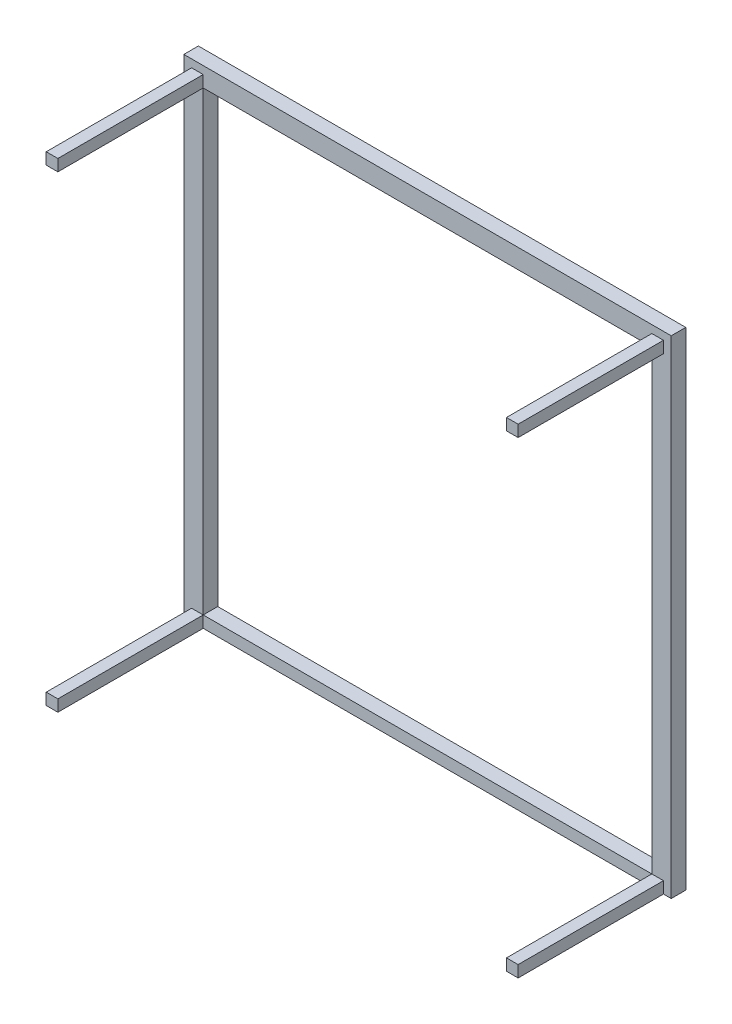
ISO-10303-21;
HEADER;
FILE_DESCRIPTION(('STEP AP214'),'2;1');
FILE_NAME('part.step','',(''),(''),'','','');
FILE_SCHEMA(('AUTOMOTIVE_DESIGN { 1 0 10303 214 1 1 1 1 }'));
ENDSEC;
DATA;
#1=APPLICATION_CONTEXT('core data for automotive mechanical design processes');
#2=APPLICATION_PROTOCOL_DEFINITION('international standard','automotive_design',2000,#1);
#3=PRODUCT_CONTEXT('',#1,'mechanical');
#4=PRODUCT('Part','Part','',(#3));
#5=PRODUCT_RELATED_PRODUCT_CATEGORY('part','',(#4));
#6=PRODUCT_DEFINITION_FORMATION('','',#4);
#7=PRODUCT_DEFINITION_CONTEXT('part definition',#1,'design');
#8=PRODUCT_DEFINITION('design','',#6,#7);
#9=PRODUCT_DEFINITION_SHAPE('','',#8);
#10=(LENGTH_UNIT() NAMED_UNIT(*) SI_UNIT(.MILLI.,.METRE.));
#11=(NAMED_UNIT(*) PLANE_ANGLE_UNIT() SI_UNIT($,.RADIAN.));
#12=(NAMED_UNIT(*) SI_UNIT($,.STERADIAN.) SOLID_ANGLE_UNIT());
#13=UNCERTAINTY_MEASURE_WITH_UNIT(LENGTH_MEASURE(1.E-05),#10,'distance_accuracy_value','');
#14=(GEOMETRIC_REPRESENTATION_CONTEXT(3) GLOBAL_UNCERTAINTY_ASSIGNED_CONTEXT((#13)) GLOBAL_UNIT_ASSIGNED_CONTEXT((#10,
#11,#12)) REPRESENTATION_CONTEXT('',''));
#15=CARTESIAN_POINT('',(0.,0.,0.));
#16=DIRECTION('',(0.,0.,1.));
#17=DIRECTION('',(1.,0.,0.));
#18=AXIS2_PLACEMENT_3D('',#15,#16,#17);
#19=CARTESIAN_POINT('',(0.,0.,15.));
#20=DIRECTION('',(0.,1.,0.));
#21=DIRECTION('',(0.,0.,1.));
#22=AXIS2_PLACEMENT_3D('',#19,#20,#21);
#23=PLANE('',#22);
#24=DIRECTION('',(1.,0.,0.));
#25=VECTOR('',#24,1.);
#26=CARTESIAN_POINT('',(8.,0.,165.));
#27=LINE('',#26,#25);
#28=CARTESIAN_POINT('',(8.,0.,165.));
#29=VERTEX_POINT('',#28);
#30=CARTESIAN_POINT('',(20.0000000000001,0.,165.));
#31=VERTEX_POINT('',#30);
#32=EDGE_CURVE('E183',#29,#31,#27,.T.);
#33=ORIENTED_EDGE('',*,*,#32,.F.);
#34=DIRECTION('',(0.,0.,-1.));
#35=VECTOR('',#34,1.);
#36=CARTESIAN_POINT('',(8.,0.,215.));
#37=LINE('',#36,#35);
#38=CARTESIAN_POINT('',(8.,0.,15.));
#39=VERTEX_POINT('',#38);
#40=EDGE_CURVE('E193',#29,#39,#37,.T.);
#41=ORIENTED_EDGE('',*,*,#40,.T.);
#42=DIRECTION('',(1.,0.,0.));
#43=VECTOR('',#42,1.);
#44=CARTESIAN_POINT('',(0.,0.,15.));
#45=LINE('',#44,#43);
#46=CARTESIAN_POINT('',(0.,0.,15.));
#47=VERTEX_POINT('',#46);
#48=EDGE_CURVE('E291',#47,#39,#45,.T.);
#49=ORIENTED_EDGE('',*,*,#48,.F.);
#50=DIRECTION('',(0.,0.,-1.));
#51=VECTOR('',#50,1.);
#52=CARTESIAN_POINT('',(0.,0.,15.));
#53=LINE('',#52,#51);
#54=CARTESIAN_POINT('',(0.,0.,0.));
#55=VERTEX_POINT('',#54);
#56=EDGE_CURVE('E41',#47,#55,#53,.T.);
#57=ORIENTED_EDGE('',*,*,#56,.T.);
#58=DIRECTION('',(1.,0.,0.));
#59=VECTOR('',#58,1.);
#60=CARTESIAN_POINT('',(0.,0.,0.));
#61=LINE('',#60,#59);
#62=CARTESIAN_POINT('',(503.,0.,0.));
#63=VERTEX_POINT('',#62);
#64=EDGE_CURVE('E301',#55,#63,#61,.T.);
#65=ORIENTED_EDGE('',*,*,#64,.T.);
#66=DIRECTION('',(0.,0.,-1.));
#67=VECTOR('',#66,1.);
#68=CARTESIAN_POINT('',(503.,0.,15.));
#69=LINE('',#68,#67);
#70=CARTESIAN_POINT('',(503.,0.,15.));
#71=VERTEX_POINT('',#70);
#72=EDGE_CURVE('E311',#71,#63,#69,.T.);
#73=ORIENTED_EDGE('',*,*,#72,.F.);
#74=CARTESIAN_POINT('',(495.,0.,15.));
#75=VERTEX_POINT('',#74);
#76=EDGE_CURVE('E289',#75,#71,#45,.T.);
#77=ORIENTED_EDGE('',*,*,#76,.F.);
#78=DIRECTION('',(0.,0.,-1.));
#79=VECTOR('',#78,1.);
#80=CARTESIAN_POINT('',(495.,0.,215.));
#81=LINE('',#80,#79);
#82=CARTESIAN_POINT('',(495.,0.,165.));
#83=VERTEX_POINT('',#82);
#84=EDGE_CURVE('E370',#83,#75,#81,.T.);
#85=ORIENTED_EDGE('',*,*,#84,.F.);
#86=CARTESIAN_POINT('',(483.,0.,165.));
#87=VERTEX_POINT('',#86);
#88=EDGE_CURVE('E197',#87,#83,#27,.T.);
#89=ORIENTED_EDGE('',*,*,#88,.F.);
#90=DIRECTION('',(0.,0.,-1.));
#91=VECTOR('',#90,1.);
#92=CARTESIAN_POINT('',(483.,0.,215.));
#93=LINE('',#92,#91);
#94=CARTESIAN_POINT('',(483.,0.,15.));
#95=VERTEX_POINT('',#94);
#96=EDGE_CURVE('E354',#87,#95,#93,.T.);
#97=ORIENTED_EDGE('',*,*,#96,.T.);
#98=CARTESIAN_POINT('',(20.0000000000001,0.,15.));
#99=VERTEX_POINT('',#98);
#100=EDGE_CURVE('E294',#99,#95,#45,.T.);
#101=ORIENTED_EDGE('',*,*,#100,.F.);
#102=DIRECTION('',(0.,0.,-1.));
#103=VECTOR('',#102,1.);
#104=CARTESIAN_POINT('',(20.0000000000001,0.,215.));
#105=LINE('',#104,#103);
#106=EDGE_CURVE('E196',#31,#99,#105,.T.);
#107=ORIENTED_EDGE('',*,*,#106,.F.);
#108=EDGE_LOOP('',(#33,#41,#49,#57,#65,#73,#77,#85,#89,#97,#101,#107));
#109=FACE_BOUND('',#108,.T.);
#110=ADVANCED_FACE('F33',(#109),#23,.F.);
#111=CARTESIAN_POINT('',(20.,483.,215.));
#112=DIRECTION('',(-1.,0.,0.));
#113=DIRECTION('',(0.,0.,1.));
#114=AXIS2_PLACEMENT_3D('',#111,#112,#113);
#115=PLANE('',#114);
#116=DIRECTION('',(0.,1.,0.));
#117=VECTOR('',#116,1.);
#118=CARTESIAN_POINT('',(20.,483.,165.));
#119=LINE('',#118,#117);
#120=CARTESIAN_POINT('',(20.,483.,165.));
#121=VERTEX_POINT('',#120);
#122=CARTESIAN_POINT('',(20.,495.,165.));
#123=VERTEX_POINT('',#122);
#124=EDGE_CURVE('E357',#121,#123,#119,.T.);
#125=ORIENTED_EDGE('',*,*,#124,.F.);
#126=DIRECTION('',(0.,0.,-1.));
#127=VECTOR('',#126,1.);
#128=CARTESIAN_POINT('',(20.,483.,215.));
#129=LINE('',#128,#127);
#130=CARTESIAN_POINT('',(20.,483.,15.));
#131=VERTEX_POINT('',#130);
#132=EDGE_CURVE('E243',#121,#131,#129,.T.);
#133=ORIENTED_EDGE('',*,*,#132,.T.);
#134=DIRECTION('',(0.,1.,0.));
#135=VECTOR('',#134,1.);
#136=CARTESIAN_POINT('',(20.,483.,15.));
#137=LINE('',#136,#135);
#138=CARTESIAN_POINT('',(20.,495.,15.));
#139=VERTEX_POINT('',#138);
#140=EDGE_CURVE('E231',#131,#139,#137,.T.);
#141=ORIENTED_EDGE('',*,*,#140,.T.);
#142=DIRECTION('',(0.,0.,-1.));
#143=VECTOR('',#142,1.);
#144=CARTESIAN_POINT('',(20.,495.,215.));
#145=LINE('',#144,#143);
#146=EDGE_CURVE('E249',#123,#139,#145,.T.);
#147=ORIENTED_EDGE('',*,*,#146,.F.);
#148=EDGE_LOOP('',(#125,#133,#141,#147));
#149=FACE_BOUND('',#148,.T.);
#150=ADVANCED_FACE('F408',(#149),#115,.F.);
#151=CARTESIAN_POINT('',(20.,495.,215.));
#152=DIRECTION('',(0.,-1.,0.));
#153=DIRECTION('',(0.,0.,-1.));
#154=AXIS2_PLACEMENT_3D('',#151,#152,#153);
#155=PLANE('',#154);
#156=DIRECTION('',(-1.,0.,0.));
#157=VECTOR('',#156,1.);
#158=CARTESIAN_POINT('',(8.,495.,165.));
#159=LINE('',#158,#157);
#160=CARTESIAN_POINT('',(8.,495.,165.));
#161=VERTEX_POINT('',#160);
#162=EDGE_CURVE('E418',#123,#161,#159,.T.);
#163=ORIENTED_EDGE('',*,*,#162,.F.);
#164=ORIENTED_EDGE('',*,*,#146,.T.);
#165=DIRECTION('',(-1.,0.,0.));
#166=VECTOR('',#165,1.);
#167=CARTESIAN_POINT('',(20.,495.,15.));
#168=LINE('',#167,#166);
#169=CARTESIAN_POINT('',(8.,495.,15.));
#170=VERTEX_POINT('',#169);
#171=EDGE_CURVE('E234',#139,#170,#168,.T.);
#172=ORIENTED_EDGE('',*,*,#171,.T.);
#173=DIRECTION('',(0.,0.,-1.));
#174=VECTOR('',#173,1.);
#175=CARTESIAN_POINT('',(8.,495.,215.));
#176=LINE('',#175,#174);
#177=EDGE_CURVE('E247',#161,#170,#176,.T.);
#178=ORIENTED_EDGE('',*,*,#177,.F.);
#179=EDGE_LOOP('',(#163,#164,#172,#178));
#180=FACE_BOUND('',#179,.T.);
#181=ADVANCED_FACE('F417',(#180),#155,.F.);
#182=CARTESIAN_POINT('',(8.,483.,215.));
#183=DIRECTION('',(1.,0.,0.));
#184=DIRECTION('',(0.,0.,-1.));
#185=AXIS2_PLACEMENT_3D('',#182,#183,#184);
#186=PLANE('',#185);
#187=DIRECTION('',(0.,-1.,0.));
#188=VECTOR('',#187,1.);
#189=CARTESIAN_POINT('',(8.,495.,165.));
#190=LINE('',#189,#188);
#191=CARTESIAN_POINT('',(8.,483.,165.));
#192=VERTEX_POINT('',#191);
#193=EDGE_CURVE('E48',#161,#192,#190,.T.);
#194=ORIENTED_EDGE('',*,*,#193,.F.);
#195=ORIENTED_EDGE('',*,*,#177,.T.);
#196=DIRECTION('',(0.,-1.,0.));
#197=VECTOR('',#196,1.);
#198=CARTESIAN_POINT('',(8.,483.,15.));
#199=LINE('',#198,#197);
#200=CARTESIAN_POINT('',(8.,483.,15.));
#201=VERTEX_POINT('',#200);
#202=EDGE_CURVE('E237',#170,#201,#199,.T.);
#203=ORIENTED_EDGE('',*,*,#202,.T.);
#204=DIRECTION('',(0.,0.,-1.));
#205=VECTOR('',#204,1.);
#206=CARTESIAN_POINT('',(8.,483.,215.));
#207=LINE('',#206,#205);
#208=EDGE_CURVE('E245',#192,#201,#207,.T.);
#209=ORIENTED_EDGE('',*,*,#208,.F.);
#210=EDGE_LOOP('',(#194,#195,#203,#209));
#211=FACE_BOUND('',#210,.T.);
#212=ADVANCED_FACE('F414',(#211),#186,.F.);
#213=CARTESIAN_POINT('',(20.,483.,215.));
#214=DIRECTION('',(0.,1.,0.));
#215=DIRECTION('',(0.,0.,1.));
#216=AXIS2_PLACEMENT_3D('',#213,#214,#215);
#217=PLANE('',#216);
#218=DIRECTION('',(1.,0.,0.));
#219=VECTOR('',#218,1.);
#220=CARTESIAN_POINT('',(20.,483.,165.));
#221=LINE('',#220,#219);
#222=EDGE_CURVE('E361',#192,#121,#221,.T.);
#223=ORIENTED_EDGE('',*,*,#222,.F.);
#224=ORIENTED_EDGE('',*,*,#208,.T.);
#225=DIRECTION('',(1.,0.,0.));
#226=VECTOR('',#225,1.);
#227=CARTESIAN_POINT('',(20.,483.,15.));
#228=LINE('',#227,#226);
#229=EDGE_CURVE('E240',#201,#131,#228,.T.);
#230=ORIENTED_EDGE('',*,*,#229,.T.);
#231=ORIENTED_EDGE('',*,*,#132,.F.);
#232=EDGE_LOOP('',(#223,#224,#230,#231));
#233=FACE_BOUND('',#232,.T.);
#234=ADVANCED_FACE('F410',(#233),#217,.F.);
#235=CARTESIAN_POINT('',(483.,483.,215.));
#236=DIRECTION('',(1.,0.,0.));
#237=DIRECTION('',(0.,0.,-1.));
#238=AXIS2_PLACEMENT_3D('',#235,#236,#237);
#239=PLANE('',#238);
#240=DIRECTION('',(0.,-1.,0.));
#241=VECTOR('',#240,1.);
#242=CARTESIAN_POINT('',(483.,483.,165.));
#243=LINE('',#242,#241);
#244=CARTESIAN_POINT('',(483.,495.,165.));
#245=VERTEX_POINT('',#244);
#246=CARTESIAN_POINT('',(483.,483.,165.));
#247=VERTEX_POINT('',#246);
#248=EDGE_CURVE('E394',#245,#247,#243,.T.);
#249=ORIENTED_EDGE('',*,*,#248,.F.);
#250=DIRECTION('',(0.,0.,-1.));
#251=VECTOR('',#250,1.);
#252=CARTESIAN_POINT('',(483.,495.,215.));
#253=LINE('',#252,#251);
#254=CARTESIAN_POINT('',(483.,495.,15.));
#255=VERTEX_POINT('',#254);
#256=EDGE_CURVE('E223',#245,#255,#253,.T.);
#257=ORIENTED_EDGE('',*,*,#256,.T.);
#258=DIRECTION('',(0.,-1.,0.));
#259=VECTOR('',#258,1.);
#260=CARTESIAN_POINT('',(483.,483.,15.));
#261=LINE('',#260,#259);
#262=CARTESIAN_POINT('',(483.,483.,15.));
#263=VERTEX_POINT('',#262);
#264=EDGE_CURVE('E211',#255,#263,#261,.T.);
#265=ORIENTED_EDGE('',*,*,#264,.T.);
#266=DIRECTION('',(0.,0.,-1.));
#267=VECTOR('',#266,1.);
#268=CARTESIAN_POINT('',(483.,483.,215.));
#269=LINE('',#268,#267);
#270=EDGE_CURVE('E229',#247,#263,#269,.T.);
#271=ORIENTED_EDGE('',*,*,#270,.F.);
#272=EDGE_LOOP('',(#249,#257,#265,#271));
#273=FACE_BOUND('',#272,.T.);
#274=ADVANCED_FACE('F482',(#273),#239,.F.);
#275=CARTESIAN_POINT('',(483.,483.,215.));
#276=DIRECTION('',(0.,1.,0.));
#277=DIRECTION('',(0.,0.,1.));
#278=AXIS2_PLACEMENT_3D('',#275,#276,#277);
#279=PLANE('',#278);
#280=DIRECTION('',(1.,0.,0.));
#281=VECTOR('',#280,1.);
#282=CARTESIAN_POINT('',(483.,483.,165.));
#283=LINE('',#282,#281);
#284=CARTESIAN_POINT('',(495.,483.,165.));
#285=VERTEX_POINT('',#284);
#286=EDGE_CURVE('E392',#247,#285,#283,.T.);
#287=ORIENTED_EDGE('',*,*,#286,.F.);
#288=ORIENTED_EDGE('',*,*,#270,.T.);
#289=DIRECTION('',(1.,0.,0.));
#290=VECTOR('',#289,1.);
#291=CARTESIAN_POINT('',(483.,483.,15.));
#292=LINE('',#291,#290);
#293=CARTESIAN_POINT('',(495.,483.,15.));
#294=VERTEX_POINT('',#293);
#295=EDGE_CURVE('E214',#263,#294,#292,.T.);
#296=ORIENTED_EDGE('',*,*,#295,.T.);
#297=DIRECTION('',(0.,0.,-1.));
#298=VECTOR('',#297,1.);
#299=CARTESIAN_POINT('',(495.,483.,215.));
#300=LINE('',#299,#298);
#301=EDGE_CURVE('E227',#285,#294,#300,.T.);
#302=ORIENTED_EDGE('',*,*,#301,.F.);
#303=EDGE_LOOP('',(#287,#288,#296,#302));
#304=FACE_BOUND('',#303,.T.);
#305=ADVANCED_FACE('F485',(#304),#279,.F.);
#306=CARTESIAN_POINT('',(495.,483.,215.));
#307=DIRECTION('',(-1.,0.,0.));
#308=DIRECTION('',(0.,0.,1.));
#309=AXIS2_PLACEMENT_3D('',#306,#307,#308);
#310=PLANE('',#309);
#311=DIRECTION('',(0.,1.,0.));
#312=VECTOR('',#311,1.);
#313=CARTESIAN_POINT('',(495.,495.,165.));
#314=LINE('',#313,#312);
#315=CARTESIAN_POINT('',(495.,495.,165.));
#316=VERTEX_POINT('',#315);
#317=EDGE_CURVE('E56',#285,#316,#314,.T.);
#318=ORIENTED_EDGE('',*,*,#317,.F.);
#319=ORIENTED_EDGE('',*,*,#301,.T.);
#320=DIRECTION('',(0.,1.,0.));
#321=VECTOR('',#320,1.);
#322=CARTESIAN_POINT('',(495.,483.,15.));
#323=LINE('',#322,#321);
#324=CARTESIAN_POINT('',(495.,495.,15.));
#325=VERTEX_POINT('',#324);
#326=EDGE_CURVE('E217',#294,#325,#323,.T.);
#327=ORIENTED_EDGE('',*,*,#326,.T.);
#328=DIRECTION('',(0.,0.,-1.));
#329=VECTOR('',#328,1.);
#330=CARTESIAN_POINT('',(495.,495.,215.));
#331=LINE('',#330,#329);
#332=EDGE_CURVE('E225',#316,#325,#331,.T.);
#333=ORIENTED_EDGE('',*,*,#332,.F.);
#334=EDGE_LOOP('',(#318,#319,#327,#333));
#335=FACE_BOUND('',#334,.T.);
#336=ADVANCED_FACE('F489',(#335),#310,.F.);
#337=CARTESIAN_POINT('',(483.,495.,215.));
#338=DIRECTION('',(0.,-1.,0.));
#339=DIRECTION('',(0.,0.,-1.));
#340=AXIS2_PLACEMENT_3D('',#337,#338,#339);
#341=PLANE('',#340);
#342=EDGE_CURVE('E443',#316,#245,#159,.T.);
#343=ORIENTED_EDGE('',*,*,#342,.F.);
#344=ORIENTED_EDGE('',*,*,#332,.T.);
#345=DIRECTION('',(-1.,0.,0.));
#346=VECTOR('',#345,1.);
#347=CARTESIAN_POINT('',(483.,495.,15.));
#348=LINE('',#347,#346);
#349=EDGE_CURVE('E220',#325,#255,#348,.T.);
#350=ORIENTED_EDGE('',*,*,#349,.T.);
#351=ORIENTED_EDGE('',*,*,#256,.F.);
#352=EDGE_LOOP('',(#343,#344,#350,#351));
#353=FACE_BOUND('',#352,.T.);
#354=ADVANCED_FACE('F493',(#353),#341,.F.);
#355=CARTESIAN_POINT('',(20.0000000000001,12.,215.));
#356=DIRECTION('',(-1.,0.,0.));
#357=DIRECTION('',(0.,0.,1.));
#358=AXIS2_PLACEMENT_3D('',#355,#356,#357);
#359=PLANE('',#358);
#360=DIRECTION('',(0.,1.,0.));
#361=VECTOR('',#360,1.);
#362=CARTESIAN_POINT('',(20.0000000000001,12.,165.));
#363=LINE('',#362,#361);
#364=CARTESIAN_POINT('',(20.0000000000001,12.,165.));
#365=VERTEX_POINT('',#364);
#366=EDGE_CURVE('E391',#31,#365,#363,.T.);
#367=ORIENTED_EDGE('',*,*,#366,.F.);
#368=ORIENTED_EDGE('',*,*,#106,.T.);
#369=DIRECTION('',(0.,1.,0.));
#370=VECTOR('',#369,1.);
#371=CARTESIAN_POINT('',(20.0000000000001,12.,15.));
#372=LINE('',#371,#370);
#373=CARTESIAN_POINT('',(20.0000000000001,12.,15.));
#374=VERTEX_POINT('',#373);
#375=EDGE_CURVE('E349',#99,#374,#372,.T.);
#376=ORIENTED_EDGE('',*,*,#375,.T.);
#377=DIRECTION('',(0.,0.,-1.));
#378=VECTOR('',#377,1.);
#379=CARTESIAN_POINT('',(20.0000000000001,12.,215.));
#380=LINE('',#379,#378);
#381=EDGE_CURVE('E205',#365,#374,#380,.T.);
#382=ORIENTED_EDGE('',*,*,#381,.F.);
#383=EDGE_LOOP('',(#367,#368,#376,#382));
#384=FACE_BOUND('',#383,.T.);
#385=ADVANCED_FACE('F390',(#384),#359,.F.);
#386=CARTESIAN_POINT('',(20.0000000000001,12.,215.));
#387=DIRECTION('',(0.,-1.,0.));
#388=DIRECTION('',(0.,0.,-1.));
#389=AXIS2_PLACEMENT_3D('',#386,#387,#388);
#390=PLANE('',#389);
#391=DIRECTION('',(-1.,0.,0.));
#392=VECTOR('',#391,1.);
#393=CARTESIAN_POINT('',(20.0000000000001,12.,165.));
#394=LINE('',#393,#392);
#395=CARTESIAN_POINT('',(8.,12.,165.));
#396=VERTEX_POINT('',#395);
#397=EDGE_CURVE('E186',#365,#396,#394,.T.);
#398=ORIENTED_EDGE('',*,*,#397,.F.);
#399=ORIENTED_EDGE('',*,*,#381,.T.);
#400=DIRECTION('',(-1.,0.,0.));
#401=VECTOR('',#400,1.);
#402=CARTESIAN_POINT('',(20.0000000000001,12.,15.));
#403=LINE('',#402,#401);
#404=CARTESIAN_POINT('',(8.,12.,15.));
#405=VERTEX_POINT('',#404);
#406=EDGE_CURVE('E374',#374,#405,#403,.T.);
#407=ORIENTED_EDGE('',*,*,#406,.T.);
#408=DIRECTION('',(0.,0.,-1.));
#409=VECTOR('',#408,1.);
#410=CARTESIAN_POINT('',(8.,12.,215.));
#411=LINE('',#410,#409);
#412=EDGE_CURVE('E203',#396,#405,#411,.T.);
#413=ORIENTED_EDGE('',*,*,#412,.F.);
#414=EDGE_LOOP('',(#398,#399,#407,#413));
#415=FACE_BOUND('',#414,.T.);
#416=ADVANCED_FACE('F378',(#415),#390,.F.);
#417=CARTESIAN_POINT('',(8.,12.,215.));
#418=DIRECTION('',(1.,0.,0.));
#419=DIRECTION('',(0.,0.,-1.));
#420=AXIS2_PLACEMENT_3D('',#417,#418,#419);
#421=PLANE('',#420);
#422=EDGE_CURVE('E180',#396,#29,#190,.T.);
#423=ORIENTED_EDGE('',*,*,#422,.F.);
#424=ORIENTED_EDGE('',*,*,#412,.T.);
#425=DIRECTION('',(0.,-1.,0.));
#426=VECTOR('',#425,1.);
#427=CARTESIAN_POINT('',(8.,12.,15.));
#428=LINE('',#427,#426);
#429=EDGE_CURVE('E202',#405,#39,#428,.T.);
#430=ORIENTED_EDGE('',*,*,#429,.T.);
#431=ORIENTED_EDGE('',*,*,#40,.F.);
#432=EDGE_LOOP('',(#423,#424,#430,#431));
#433=FACE_BOUND('',#432,.T.);
#434=ADVANCED_FACE('F200',(#433),#421,.F.);
#435=CARTESIAN_POINT('',(483.,12.,215.));
#436=DIRECTION('',(1.,0.,0.));
#437=DIRECTION('',(0.,0.,-1.));
#438=AXIS2_PLACEMENT_3D('',#435,#436,#437);
#439=PLANE('',#438);
#440=DIRECTION('',(0.,-1.,0.));
#441=VECTOR('',#440,1.);
#442=CARTESIAN_POINT('',(483.,12.,165.));
#443=LINE('',#442,#441);
#444=CARTESIAN_POINT('',(483.,12.,165.));
#445=VERTEX_POINT('',#444);
#446=EDGE_CURVE('E396',#445,#87,#443,.T.);
#447=ORIENTED_EDGE('',*,*,#446,.F.);
#448=DIRECTION('',(0.,0.,-1.));
#449=VECTOR('',#448,1.);
#450=CARTESIAN_POINT('',(483.,12.,215.));
#451=LINE('',#450,#449);
#452=CARTESIAN_POINT('',(483.,12.,15.));
#453=VERTEX_POINT('',#452);
#454=EDGE_CURVE('E356',#445,#453,#451,.T.);
#455=ORIENTED_EDGE('',*,*,#454,.T.);
#456=DIRECTION('',(0.,-1.,0.));
#457=VECTOR('',#456,1.);
#458=CARTESIAN_POINT('',(483.,12.,15.));
#459=LINE('',#458,#457);
#460=EDGE_CURVE('E347',#453,#95,#459,.T.);
#461=ORIENTED_EDGE('',*,*,#460,.T.);
#462=ORIENTED_EDGE('',*,*,#96,.F.);
#463=EDGE_LOOP('',(#447,#455,#461,#462));
#464=FACE_BOUND('',#463,.T.);
#465=ADVANCED_FACE('F353',(#464),#439,.F.);
#466=CARTESIAN_POINT('',(495.,12.,215.));
#467=DIRECTION('',(-1.,0.,0.));
#468=DIRECTION('',(0.,0.,1.));
#469=AXIS2_PLACEMENT_3D('',#466,#467,#468);
#470=PLANE('',#469);
#471=CARTESIAN_POINT('',(495.,12.,165.));
#472=VERTEX_POINT('',#471);
#473=EDGE_CURVE('E438',#83,#472,#314,.T.);
#474=ORIENTED_EDGE('',*,*,#473,.F.);
#475=ORIENTED_EDGE('',*,*,#84,.T.);
#476=DIRECTION('',(0.,1.,0.));
#477=VECTOR('',#476,1.);
#478=CARTESIAN_POINT('',(495.,12.,15.));
#479=LINE('',#478,#477);
#480=CARTESIAN_POINT('',(495.,12.,15.));
#481=VERTEX_POINT('',#480);
#482=EDGE_CURVE('E338',#75,#481,#479,.T.);
#483=ORIENTED_EDGE('',*,*,#482,.T.);
#484=DIRECTION('',(0.,0.,-1.));
#485=VECTOR('',#484,1.);
#486=CARTESIAN_POINT('',(495.,12.,215.));
#487=LINE('',#486,#485);
#488=EDGE_CURVE('E368',#472,#481,#487,.T.);
#489=ORIENTED_EDGE('',*,*,#488,.F.);
#490=EDGE_LOOP('',(#474,#475,#483,#489));
#491=FACE_BOUND('',#490,.T.);
#492=ADVANCED_FACE('F437',(#491),#470,.F.);
#493=CARTESIAN_POINT('',(483.,12.,215.));
#494=DIRECTION('',(0.,-1.,0.));
#495=DIRECTION('',(0.,0.,-1.));
#496=AXIS2_PLACEMENT_3D('',#493,#494,#495);
#497=PLANE('',#496);
#498=DIRECTION('',(-1.,0.,0.));
#499=VECTOR('',#498,1.);
#500=CARTESIAN_POINT('',(483.,12.,165.));
#501=LINE('',#500,#499);
#502=EDGE_CURVE('E11',#472,#445,#501,.T.);
#503=ORIENTED_EDGE('',*,*,#502,.F.);
#504=ORIENTED_EDGE('',*,*,#488,.T.);
#505=DIRECTION('',(-1.,0.,0.));
#506=VECTOR('',#505,1.);
#507=CARTESIAN_POINT('',(483.,12.,15.));
#508=LINE('',#507,#506);
#509=EDGE_CURVE('E359',#481,#453,#508,.T.);
#510=ORIENTED_EDGE('',*,*,#509,.T.);
#511=ORIENTED_EDGE('',*,*,#454,.F.);
#512=EDGE_LOOP('',(#503,#504,#510,#511));
#513=FACE_BOUND('',#512,.T.);
#514=ADVANCED_FACE('F433',(#513),#497,.F.);
#515=CARTESIAN_POINT('',(0.,0.,15.));
#516=DIRECTION('',(0.,0.,-1.));
#517=DIRECTION('',(-1.,0.,0.));
#518=AXIS2_PLACEMENT_3D('',#515,#516,#517);
#519=PLANE('',#518);
#520=ORIENTED_EDGE('',*,*,#460,.F.);
#521=DIRECTION('',(1.,0.,0.));
#522=VECTOR('',#521,1.);
#523=CARTESIAN_POINT('',(20.0000000000001,12.,15.));
#524=LINE('',#523,#522);
#525=EDGE_CURVE('E255',#374,#453,#524,.T.);
#526=ORIENTED_EDGE('',*,*,#525,.F.);
#527=ORIENTED_EDGE('',*,*,#375,.F.);
#528=ORIENTED_EDGE('',*,*,#100,.T.);
#529=EDGE_LOOP('',(#520,#526,#527,#528));
#530=FACE_BOUND('',#529,.T.);
#531=ADVANCED_FACE('F345',(#530),#519,.F.);
#532=ORIENTED_EDGE('',*,*,#482,.F.);
#533=ORIENTED_EDGE('',*,*,#76,.T.);
#534=DIRECTION('',(0.,1.,0.));
#535=VECTOR('',#534,1.);
#536=CARTESIAN_POINT('',(503.,0.,15.));
#537=LINE('',#536,#535);
#538=CARTESIAN_POINT('',(503.,503.,15.));
#539=VERTEX_POINT('',#538);
#540=EDGE_CURVE('E293',#71,#539,#537,.T.);
#541=ORIENTED_EDGE('',*,*,#540,.T.);
#542=DIRECTION('',(-1.,0.,0.));
#543=VECTOR('',#542,1.);
#544=CARTESIAN_POINT('',(0.,503.,15.));
#545=LINE('',#544,#543);
#546=CARTESIAN_POINT('',(0.,503.,15.));
#547=VERTEX_POINT('',#546);
#548=EDGE_CURVE('E296',#539,#547,#545,.T.);
#549=ORIENTED_EDGE('',*,*,#548,.T.);
#550=DIRECTION('',(0.,-1.,0.));
#551=VECTOR('',#550,1.);
#552=CARTESIAN_POINT('',(0.,0.,15.));
#553=LINE('',#552,#551);
#554=EDGE_CURVE('E286',#547,#47,#553,.T.);
#555=ORIENTED_EDGE('',*,*,#554,.T.);
#556=ORIENTED_EDGE('',*,*,#48,.T.);
#557=ORIENTED_EDGE('',*,*,#429,.F.);
#558=ORIENTED_EDGE('',*,*,#406,.F.);
#559=DIRECTION('',(0.,-1.,0.));
#560=VECTOR('',#559,1.);
#561=CARTESIAN_POINT('',(20.,483.,15.));
#562=LINE('',#561,#560);
#563=EDGE_CURVE('E252',#131,#374,#562,.T.);
#564=ORIENTED_EDGE('',*,*,#563,.F.);
#565=ORIENTED_EDGE('',*,*,#229,.F.);
#566=ORIENTED_EDGE('',*,*,#202,.F.);
#567=ORIENTED_EDGE('',*,*,#171,.F.);
#568=ORIENTED_EDGE('',*,*,#140,.F.);
#569=DIRECTION('',(-1.,0.,0.));
#570=VECTOR('',#569,1.);
#571=CARTESIAN_POINT('',(20.,483.,15.));
#572=LINE('',#571,#570);
#573=EDGE_CURVE('E262',#263,#131,#572,.T.);
#574=ORIENTED_EDGE('',*,*,#573,.F.);
#575=ORIENTED_EDGE('',*,*,#264,.F.);
#576=ORIENTED_EDGE('',*,*,#349,.F.);
#577=ORIENTED_EDGE('',*,*,#326,.F.);
#578=ORIENTED_EDGE('',*,*,#295,.F.);
#579=DIRECTION('',(0.,1.,0.));
#580=VECTOR('',#579,1.);
#581=CARTESIAN_POINT('',(483.,483.,15.));
#582=LINE('',#581,#580);
#583=EDGE_CURVE('E259',#453,#263,#582,.T.);
#584=ORIENTED_EDGE('',*,*,#583,.F.);
#585=ORIENTED_EDGE('',*,*,#509,.F.);
#586=EDGE_LOOP('',(#532,#533,#541,#549,#555,#556,#557,#558,#564,#565,#566,#567,#568,#574,#575,
#576,#577,#578,#584,#585));
#587=FACE_BOUND('',#586,.T.);
#588=ADVANCED_FACE('F334',(#587),#519,.F.);
#589=CARTESIAN_POINT('',(0.,0.,0.));
#590=DIRECTION('',(0.,0.,-1.));
#591=DIRECTION('',(-1.,0.,0.));
#592=AXIS2_PLACEMENT_3D('',#589,#590,#591);
#593=PLANE('',#592);
#594=DIRECTION('',(0.,-1.,0.));
#595=VECTOR('',#594,1.);
#596=CARTESIAN_POINT('',(0.,0.,0.));
#597=LINE('',#596,#595);
#598=CARTESIAN_POINT('',(0.,503.,0.));
#599=VERTEX_POINT('',#598);
#600=EDGE_CURVE('E285',#599,#55,#597,.T.);
#601=ORIENTED_EDGE('',*,*,#600,.F.);
#602=DIRECTION('',(-1.,0.,0.));
#603=VECTOR('',#602,1.);
#604=CARTESIAN_POINT('',(0.,503.,0.));
#605=LINE('',#604,#603);
#606=CARTESIAN_POINT('',(503.,503.,0.));
#607=VERTEX_POINT('',#606);
#608=EDGE_CURVE('E290',#607,#599,#605,.T.);
#609=ORIENTED_EDGE('',*,*,#608,.F.);
#610=DIRECTION('',(0.,1.,0.));
#611=VECTOR('',#610,1.);
#612=CARTESIAN_POINT('',(503.,0.,0.));
#613=LINE('',#612,#611);
#614=EDGE_CURVE('E303',#63,#607,#613,.T.);
#615=ORIENTED_EDGE('',*,*,#614,.F.);
#616=ORIENTED_EDGE('',*,*,#64,.F.);
#617=EDGE_LOOP('',(#601,#609,#615,#616));
#618=FACE_BOUND('',#617,.T.);
#619=DIRECTION('',(-1.,0.,0.));
#620=VECTOR('',#619,1.);
#621=CARTESIAN_POINT('',(20.,483.,0.));
#622=LINE('',#621,#620);
#623=CARTESIAN_POINT('',(483.,483.,0.));
#624=VERTEX_POINT('',#623);
#625=CARTESIAN_POINT('',(20.,483.,0.));
#626=VERTEX_POINT('',#625);
#627=EDGE_CURVE('E256',#624,#626,#622,.T.);
#628=ORIENTED_EDGE('',*,*,#627,.T.);
#629=DIRECTION('',(0.,-1.,0.));
#630=VECTOR('',#629,1.);
#631=CARTESIAN_POINT('',(20.,483.,0.));
#632=LINE('',#631,#630);
#633=CARTESIAN_POINT('',(20.0000000000001,12.,0.));
#634=VERTEX_POINT('',#633);
#635=EDGE_CURVE('E251',#626,#634,#632,.T.);
#636=ORIENTED_EDGE('',*,*,#635,.T.);
#637=DIRECTION('',(1.,0.,0.));
#638=VECTOR('',#637,1.);
#639=CARTESIAN_POINT('',(20.0000000000001,12.,0.));
#640=LINE('',#639,#638);
#641=CARTESIAN_POINT('',(483.,12.,0.));
#642=VERTEX_POINT('',#641);
#643=EDGE_CURVE('E268',#634,#642,#640,.T.);
#644=ORIENTED_EDGE('',*,*,#643,.T.);
#645=DIRECTION('',(0.,1.,0.));
#646=VECTOR('',#645,1.);
#647=CARTESIAN_POINT('',(483.,483.,0.));
#648=LINE('',#647,#646);
#649=EDGE_CURVE('E271',#642,#624,#648,.T.);
#650=ORIENTED_EDGE('',*,*,#649,.T.);
#651=EDGE_LOOP('',(#628,#636,#644,#650));
#652=FACE_BOUND('',#651,.T.);
#653=ADVANCED_FACE('F322',(#618,#652),#593,.T.);
#654=CARTESIAN_POINT('',(0.,0.,15.));
#655=DIRECTION('',(1.,0.,0.));
#656=DIRECTION('',(0.,0.,-1.));
#657=AXIS2_PLACEMENT_3D('',#654,#655,#656);
#658=PLANE('',#657);
#659=ORIENTED_EDGE('',*,*,#600,.T.);
#660=ORIENTED_EDGE('',*,*,#56,.F.);
#661=ORIENTED_EDGE('',*,*,#554,.F.);
#662=DIRECTION('',(0.,0.,-1.));
#663=VECTOR('',#662,1.);
#664=CARTESIAN_POINT('',(0.,503.,15.));
#665=LINE('',#664,#663);
#666=EDGE_CURVE('E298',#547,#599,#665,.T.);
#667=ORIENTED_EDGE('',*,*,#666,.T.);
#668=EDGE_LOOP('',(#659,#660,#661,#667));
#669=FACE_BOUND('',#668,.T.);
#670=ADVANCED_FACE('F35',(#669),#658,.F.);
#671=CARTESIAN_POINT('',(503.,0.,15.));
#672=DIRECTION('',(-1.,0.,0.));
#673=DIRECTION('',(0.,0.,1.));
#674=AXIS2_PLACEMENT_3D('',#671,#672,#673);
#675=PLANE('',#674);
#676=ORIENTED_EDGE('',*,*,#614,.T.);
#677=DIRECTION('',(0.,0.,-1.));
#678=VECTOR('',#677,1.);
#679=CARTESIAN_POINT('',(503.,503.,15.));
#680=LINE('',#679,#678);
#681=EDGE_CURVE('E308',#539,#607,#680,.T.);
#682=ORIENTED_EDGE('',*,*,#681,.F.);
#683=ORIENTED_EDGE('',*,*,#540,.F.);
#684=ORIENTED_EDGE('',*,*,#72,.T.);
#685=EDGE_LOOP('',(#676,#682,#683,#684));
#686=FACE_BOUND('',#685,.T.);
#687=ADVANCED_FACE('F327',(#686),#675,.F.);
#688=CARTESIAN_POINT('',(0.,503.,15.));
#689=DIRECTION('',(0.,-1.,0.));
#690=DIRECTION('',(0.,0.,-1.));
#691=AXIS2_PLACEMENT_3D('',#688,#689,#690);
#692=PLANE('',#691);
#693=ORIENTED_EDGE('',*,*,#608,.T.);
#694=ORIENTED_EDGE('',*,*,#666,.F.);
#695=ORIENTED_EDGE('',*,*,#548,.F.);
#696=ORIENTED_EDGE('',*,*,#681,.T.);
#697=EDGE_LOOP('',(#693,#694,#695,#696));
#698=FACE_BOUND('',#697,.T.);
#699=ADVANCED_FACE('F331',(#698),#692,.F.);
#700=CARTESIAN_POINT('',(20.,483.,15.));
#701=DIRECTION('',(1.,0.,0.));
#702=DIRECTION('',(0.,1.,0.));
#703=AXIS2_PLACEMENT_3D('',#700,#701,#702);
#704=PLANE('',#703);
#705=ORIENTED_EDGE('',*,*,#635,.F.);
#706=DIRECTION('',(0.,0.,-1.));
#707=VECTOR('',#706,1.);
#708=CARTESIAN_POINT('',(20.,483.,15.));
#709=LINE('',#708,#707);
#710=EDGE_CURVE('E265',#131,#626,#709,.T.);
#711=ORIENTED_EDGE('',*,*,#710,.F.);
#712=ORIENTED_EDGE('',*,*,#563,.T.);
#713=DIRECTION('',(0.,0.,-1.));
#714=VECTOR('',#713,1.);
#715=CARTESIAN_POINT('',(20.0000000000001,12.,15.));
#716=LINE('',#715,#714);
#717=EDGE_CURVE('E282',#374,#634,#716,.T.);
#718=ORIENTED_EDGE('',*,*,#717,.T.);
#719=EDGE_LOOP('',(#705,#711,#712,#718));
#720=FACE_BOUND('',#719,.T.);
#721=ADVANCED_FACE('F385',(#720),#704,.T.);
#722=CARTESIAN_POINT('',(20.0000000000001,12.,15.));
#723=DIRECTION('',(0.,1.,0.));
#724=DIRECTION('',(0.,0.,1.));
#725=AXIS2_PLACEMENT_3D('',#722,#723,#724);
#726=PLANE('',#725);
#727=ORIENTED_EDGE('',*,*,#643,.F.);
#728=ORIENTED_EDGE('',*,*,#717,.F.);
#729=ORIENTED_EDGE('',*,*,#525,.T.);
#730=DIRECTION('',(0.,0.,-1.));
#731=VECTOR('',#730,1.);
#732=CARTESIAN_POINT('',(483.,12.,15.));
#733=LINE('',#732,#731);
#734=EDGE_CURVE('E280',#453,#642,#733,.T.);
#735=ORIENTED_EDGE('',*,*,#734,.T.);
#736=EDGE_LOOP('',(#727,#728,#729,#735));
#737=FACE_BOUND('',#736,.T.);
#738=ADVANCED_FACE('F387',(#737),#726,.T.);
#739=CARTESIAN_POINT('',(483.,483.,15.));
#740=DIRECTION('',(-1.,0.,0.));
#741=DIRECTION('',(0.,-1.,0.));
#742=AXIS2_PLACEMENT_3D('',#739,#740,#741);
#743=PLANE('',#742);
#744=ORIENTED_EDGE('',*,*,#649,.F.);
#745=ORIENTED_EDGE('',*,*,#734,.F.);
#746=ORIENTED_EDGE('',*,*,#583,.T.);
#747=DIRECTION('',(0.,0.,-1.));
#748=VECTOR('',#747,1.);
#749=CARTESIAN_POINT('',(483.,483.,15.));
#750=LINE('',#749,#748);
#751=EDGE_CURVE('E278',#263,#624,#750,.T.);
#752=ORIENTED_EDGE('',*,*,#751,.T.);
#753=EDGE_LOOP('',(#744,#745,#746,#752));
#754=FACE_BOUND('',#753,.T.);
#755=ADVANCED_FACE('F428',(#754),#743,.T.);
#756=CARTESIAN_POINT('',(20.,483.,15.));
#757=DIRECTION('',(0.,-1.,0.));
#758=DIRECTION('',(0.,0.,-1.));
#759=AXIS2_PLACEMENT_3D('',#756,#757,#758);
#760=PLANE('',#759);
#761=ORIENTED_EDGE('',*,*,#627,.F.);
#762=ORIENTED_EDGE('',*,*,#751,.F.);
#763=ORIENTED_EDGE('',*,*,#573,.T.);
#764=ORIENTED_EDGE('',*,*,#710,.T.);
#765=EDGE_LOOP('',(#761,#762,#763,#764));
#766=FACE_BOUND('',#765,.T.);
#767=ADVANCED_FACE('F424',(#766),#760,.T.);
#768=CARTESIAN_POINT('',(0.,0.,165.));
#769=DIRECTION('',(0.,0.,1.));
#770=DIRECTION('',(1.,0.,0.));
#771=AXIS2_PLACEMENT_3D('',#768,#769,#770);
#772=PLANE('',#771);
#773=ORIENTED_EDGE('',*,*,#446,.T.);
#774=ORIENTED_EDGE('',*,*,#88,.T.);
#775=ORIENTED_EDGE('',*,*,#473,.T.);
#776=ORIENTED_EDGE('',*,*,#502,.T.);
#777=EDGE_LOOP('',(#773,#774,#775,#776));
#778=FACE_BOUND('',#777,.T.);
#779=ADVANCED_FACE('F444',(#778),#772,.T.);
#780=ORIENTED_EDGE('',*,*,#366,.T.);
#781=ORIENTED_EDGE('',*,*,#397,.T.);
#782=ORIENTED_EDGE('',*,*,#422,.T.);
#783=ORIENTED_EDGE('',*,*,#32,.T.);
#784=EDGE_LOOP('',(#780,#781,#782,#783));
#785=FACE_BOUND('',#784,.T.);
#786=ADVANCED_FACE('F182',(#785),#772,.T.);
#787=ORIENTED_EDGE('',*,*,#248,.T.);
#788=ORIENTED_EDGE('',*,*,#286,.T.);
#789=ORIENTED_EDGE('',*,*,#317,.T.);
#790=ORIENTED_EDGE('',*,*,#342,.T.);
#791=EDGE_LOOP('',(#787,#788,#789,#790));
#792=FACE_BOUND('',#791,.T.);
#793=ADVANCED_FACE('F451',(#792),#772,.T.);
#794=ORIENTED_EDGE('',*,*,#124,.T.);
#795=ORIENTED_EDGE('',*,*,#162,.T.);
#796=ORIENTED_EDGE('',*,*,#193,.T.);
#797=ORIENTED_EDGE('',*,*,#222,.T.);
#798=EDGE_LOOP('',(#794,#795,#796,#797));
#799=FACE_BOUND('',#798,.T.);
#800=ADVANCED_FACE('F401',(#799),#772,.T.);
#801=CLOSED_SHELL('',(#110,#150,#181,#212,#234,#274,#305,#336,#354,#385,#416,#434,#465,#492,
#514,#531,#588,#653,#670,#687,#699,#721,#738,#755,#767,#779,#786,#793,#800));
#802=MANIFOLD_SOLID_BREP('B2',#801);
#803=ADVANCED_BREP_SHAPE_REPRESENTATION('',(#18,#802),#14);
#804=SHAPE_DEFINITION_REPRESENTATION(#9,#803);
ENDSEC;
END-ISO-10303-21;
